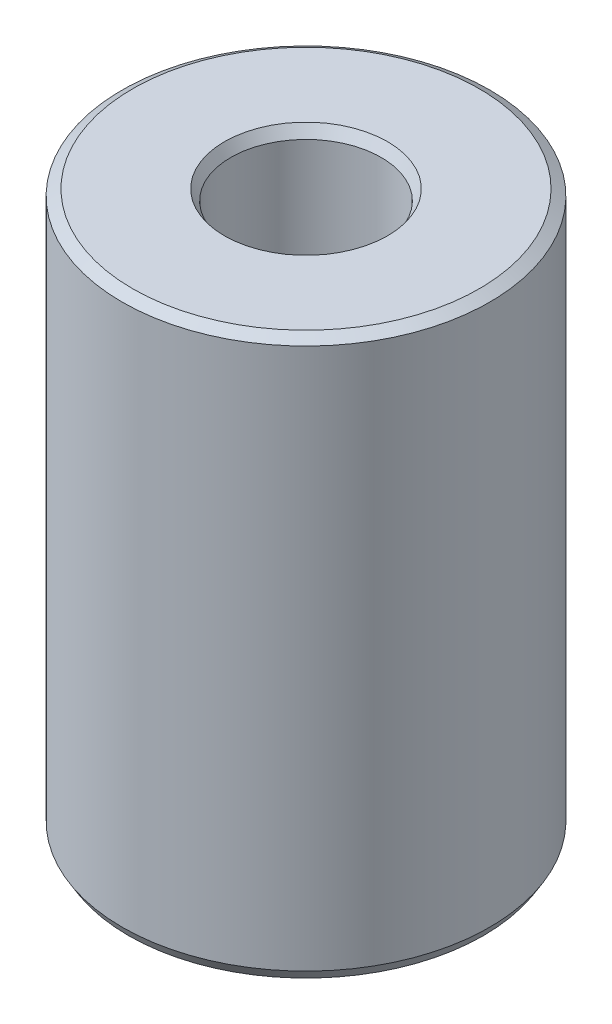
ISO-10303-21;
HEADER;
FILE_DESCRIPTION(('STEP AP214'),'2;1');
FILE_NAME('part.step','',(''),(''),'','','');
FILE_SCHEMA(('AUTOMOTIVE_DESIGN { 1 0 10303 214 1 1 1 1 }'));
ENDSEC;
DATA;
#1=APPLICATION_CONTEXT('core data for automotive mechanical design processes');
#2=APPLICATION_PROTOCOL_DEFINITION('international standard','automotive_design',2000,#1);
#3=PRODUCT_CONTEXT('',#1,'mechanical');
#4=PRODUCT('Part','Part','',(#3));
#5=PRODUCT_RELATED_PRODUCT_CATEGORY('part','',(#4));
#6=PRODUCT_DEFINITION_FORMATION('','',#4);
#7=PRODUCT_DEFINITION_CONTEXT('part definition',#1,'design');
#8=PRODUCT_DEFINITION('design','',#6,#7);
#9=PRODUCT_DEFINITION_SHAPE('','',#8);
#10=(LENGTH_UNIT() NAMED_UNIT(*) SI_UNIT(.MILLI.,.METRE.));
#11=(NAMED_UNIT(*) PLANE_ANGLE_UNIT() SI_UNIT($,.RADIAN.));
#12=(NAMED_UNIT(*) SI_UNIT($,.STERADIAN.) SOLID_ANGLE_UNIT());
#13=UNCERTAINTY_MEASURE_WITH_UNIT(LENGTH_MEASURE(1.E-05),#10,'distance_accuracy_value','');
#14=(GEOMETRIC_REPRESENTATION_CONTEXT(3) GLOBAL_UNCERTAINTY_ASSIGNED_CONTEXT((#13)) GLOBAL_UNIT_ASSIGNED_CONTEXT((#10,
#11,#12)) REPRESENTATION_CONTEXT('',''));
#15=CARTESIAN_POINT('',(0.,0.,0.));
#16=DIRECTION('',(0.,0.,1.));
#17=DIRECTION('',(1.,0.,0.));
#18=AXIS2_PLACEMENT_3D('',#15,#16,#17);
#19=CARTESIAN_POINT('',(0.,53.1470555804414,0.));
#20=DIRECTION('',(0.,-1.,0.));
#21=DIRECTION('',(0.,0.,-1.));
#22=AXIS2_PLACEMENT_3D('',#19,#20,#21);
#23=CYLINDRICAL_SURFACE('',#22,17.5);
#24=CARTESIAN_POINT('',(0.,0.998900580231762,0.));
#25=DIRECTION('',(0.,1.,0.));
#26=DIRECTION('',(0.,0.,1.));
#27=AXIS2_PLACEMENT_3D('',#24,#25,#26);
#28=CIRCLE('',#27,17.5);
#29=CARTESIAN_POINT('',(0.,0.998900580231762,17.5));
#30=VERTEX_POINT('',#29);
#31=EDGE_CURVE('E10',#30,#30,#28,.T.);
#32=ORIENTED_EDGE('',*,*,#31,.T.);
#33=EDGE_LOOP('',(#32));
#34=FACE_BOUND('',#33,.T.);
#35=CARTESIAN_POINT('',(0.,52.5463067371029,0.));
#36=DIRECTION('',(0.,1.,0.));
#37=DIRECTION('',(0.,0.,1.));
#38=AXIS2_PLACEMENT_3D('',#35,#36,#37);
#39=CIRCLE('',#38,17.5);
#40=CARTESIAN_POINT('',(0.,52.5463067371029,17.5));
#41=VERTEX_POINT('',#40);
#42=EDGE_CURVE('E50',#41,#41,#39,.F.);
#43=ORIENTED_EDGE('',*,*,#42,.T.);
#44=EDGE_LOOP('',(#43));
#45=FACE_BOUND('',#44,.T.);
#46=ADVANCED_FACE('F39',(#34,#45),#23,.T.);
#47=CARTESIAN_POINT('',(0.,53.1470555804414,0.));
#48=DIRECTION('',(0.,1.,0.));
#49=DIRECTION('',(0.,0.,1.));
#50=AXIS2_PLACEMENT_3D('',#47,#48,#49);
#51=PLANE('',#50);
#52=CARTESIAN_POINT('',(0.,53.1470555804414,0.));
#53=DIRECTION('',(0.,1.,0.));
#54=DIRECTION('',(0.,0.,1.));
#55=AXIS2_PLACEMENT_3D('',#52,#53,#54);
#56=CIRCLE('',#55,7.76723456827775);
#57=CARTESIAN_POINT('',(0.,53.1470555804414,7.76723456827775));
#58=VERTEX_POINT('',#57);
#59=EDGE_CURVE('E58',#58,#58,#56,.F.);
#60=ORIENTED_EDGE('',*,*,#59,.T.);
#61=EDGE_LOOP('',(#60));
#62=FACE_BOUND('',#61,.T.);
#63=CARTESIAN_POINT('',(0.,53.1470555804414,0.));
#64=DIRECTION('',(0.,1.,0.));
#65=DIRECTION('',(0.,0.,1.));
#66=AXIS2_PLACEMENT_3D('',#63,#64,#65);
#67=CIRCLE('',#66,16.5010994197683);
#68=CARTESIAN_POINT('',(0.,53.1470555804414,16.5010994197683));
#69=VERTEX_POINT('',#68);
#70=EDGE_CURVE('E61',#69,#69,#67,.T.);
#71=ORIENTED_EDGE('',*,*,#70,.T.);
#72=EDGE_LOOP('',(#71));
#73=FACE_BOUND('',#72,.T.);
#74=ADVANCED_FACE('F88',(#62,#73),#51,.T.);
#75=CARTESIAN_POINT('',(0.,0.,0.));
#76=DIRECTION('',(0.,1.,0.));
#77=DIRECTION('',(0.,0.,1.));
#78=AXIS2_PLACEMENT_3D('',#75,#76,#77);
#79=PLANE('',#78);
#80=CARTESIAN_POINT('',(0.,0.,0.));
#81=DIRECTION('',(0.,1.,0.));
#82=DIRECTION('',(0.,0.,1.));
#83=AXIS2_PLACEMENT_3D('',#80,#81,#82);
#84=CIRCLE('',#83,8.16538630517098);
#85=CARTESIAN_POINT('',(0.,0.,8.16538630517098));
#86=VERTEX_POINT('',#85);
#87=EDGE_CURVE('E51',#86,#86,#84,.T.);
#88=ORIENTED_EDGE('',*,*,#87,.T.);
#89=EDGE_LOOP('',(#88));
#90=FACE_BOUND('',#89,.T.);
#91=CARTESIAN_POINT('',(0.,0.,0.));
#92=DIRECTION('',(0.,1.,0.));
#93=DIRECTION('',(0.,0.,1.));
#94=AXIS2_PLACEMENT_3D('',#91,#92,#93);
#95=CIRCLE('',#94,16.8992511566614);
#96=CARTESIAN_POINT('',(0.,0.,16.8992511566614));
#97=VERTEX_POINT('',#96);
#98=EDGE_CURVE('E54',#97,#97,#95,.F.);
#99=ORIENTED_EDGE('',*,*,#98,.T.);
#100=EDGE_LOOP('',(#99));
#101=FACE_BOUND('',#100,.T.);
#102=ADVANCED_FACE('F83',(#90,#101),#79,.F.);
#103=CARTESIAN_POINT('',(0.,53.1470555804414,0.));
#104=DIRECTION('',(0.,-1.,0.));
#105=DIRECTION('',(0.,0.,-1.));
#106=AXIS2_PLACEMENT_3D('',#103,#104,#105);
#107=CYLINDRICAL_SURFACE('',#106,7.16648572493922);
#108=CARTESIAN_POINT('',(0.,52.1481550002097,0.));
#109=DIRECTION('',(0.,1.,0.));
#110=DIRECTION('',(0.,0.,1.));
#111=AXIS2_PLACEMENT_3D('',#108,#109,#110);
#112=CIRCLE('',#111,7.16648572493922);
#113=CARTESIAN_POINT('',(0.,52.1481550002097,7.16648572493922));
#114=VERTEX_POINT('',#113);
#115=EDGE_CURVE('E67',#114,#114,#112,.T.);
#116=ORIENTED_EDGE('',*,*,#115,.T.);
#117=EDGE_LOOP('',(#116));
#118=FACE_BOUND('',#117,.T.);
#119=CARTESIAN_POINT('',(0.,0.600748843338557,0.));
#120=DIRECTION('',(0.,1.,0.));
#121=DIRECTION('',(0.,0.,1.));
#122=AXIS2_PLACEMENT_3D('',#119,#120,#121);
#123=CIRCLE('',#122,7.16648572493922);
#124=CARTESIAN_POINT('',(0.,0.600748843338557,7.16648572493922));
#125=VERTEX_POINT('',#124);
#126=EDGE_CURVE('E69',#125,#125,#123,.F.);
#127=ORIENTED_EDGE('',*,*,#126,.T.);
#128=EDGE_LOOP('',(#127));
#129=FACE_BOUND('',#128,.T.);
#130=ADVANCED_FACE('F71',(#118,#129),#107,.F.);
#131=CARTESIAN_POINT('',(0.,52.1481550002097,0.));
#132=DIRECTION('',(0.,1.,0.));
#133=DIRECTION('',(0.,0.,1.));
#134=AXIS2_PLACEMENT_3D('',#131,#132,#133);
#135=CONICAL_SURFACE('',#134,7.16648572493922,0.541455653441815);
#136=ORIENTED_EDGE('',*,*,#59,.F.);
#137=EDGE_LOOP('',(#136));
#138=FACE_BOUND('',#137,.T.);
#139=ORIENTED_EDGE('',*,*,#115,.F.);
#140=EDGE_LOOP('',(#139));
#141=FACE_BOUND('',#140,.T.);
#142=ADVANCED_FACE('F77',(#138,#141),#135,.F.);
#143=CARTESIAN_POINT('',(0.,0.,0.));
#144=DIRECTION('',(0.,-1.,0.));
#145=DIRECTION('',(0.,0.,-1.));
#146=AXIS2_PLACEMENT_3D('',#143,#144,#145);
#147=CONICAL_SURFACE('',#146,8.16538630517098,1.02934067335308);
#148=ORIENTED_EDGE('',*,*,#126,.F.);
#149=EDGE_LOOP('',(#148));
#150=FACE_BOUND('',#149,.T.);
#151=ORIENTED_EDGE('',*,*,#87,.F.);
#152=EDGE_LOOP('',(#151));
#153=FACE_BOUND('',#152,.T.);
#154=ADVANCED_FACE('F73',(#150,#153),#147,.F.);
#155=CARTESIAN_POINT('',(0.,0.998900580231762,0.));
#156=DIRECTION('',(0.,1.,0.));
#157=DIRECTION('',(0.,0.,1.));
#158=AXIS2_PLACEMENT_3D('',#155,#156,#157);
#159=CONICAL_SURFACE('',#158,17.5,0.541455653441819);
#160=ORIENTED_EDGE('',*,*,#98,.F.);
#161=EDGE_LOOP('',(#160));
#162=FACE_BOUND('',#161,.T.);
#163=ORIENTED_EDGE('',*,*,#31,.F.);
#164=EDGE_LOOP('',(#163));
#165=FACE_BOUND('',#164,.T.);
#166=ADVANCED_FACE('F76',(#162,#165),#159,.T.);
#167=CARTESIAN_POINT('',(0.,53.1470555804414,0.));
#168=DIRECTION('',(0.,-1.,0.));
#169=DIRECTION('',(0.,0.,-1.));
#170=AXIS2_PLACEMENT_3D('',#167,#168,#169);
#171=CONICAL_SURFACE('',#170,16.5010994197683,1.02934067335308);
#172=ORIENTED_EDGE('',*,*,#42,.F.);
#173=EDGE_LOOP('',(#172));
#174=FACE_BOUND('',#173,.T.);
#175=ORIENTED_EDGE('',*,*,#70,.F.);
#176=EDGE_LOOP('',(#175));
#177=FACE_BOUND('',#176,.T.);
#178=ADVANCED_FACE('F45',(#174,#177),#171,.T.);
#179=CLOSED_SHELL('',(#46,#74,#102,#130,#142,#154,#166,#178));
#180=MANIFOLD_SOLID_BREP('B2',#179);
#181=ADVANCED_BREP_SHAPE_REPRESENTATION('',(#18,#180),#14);
#182=SHAPE_DEFINITION_REPRESENTATION(#9,#181);
ENDSEC;
END-ISO-10303-21;
